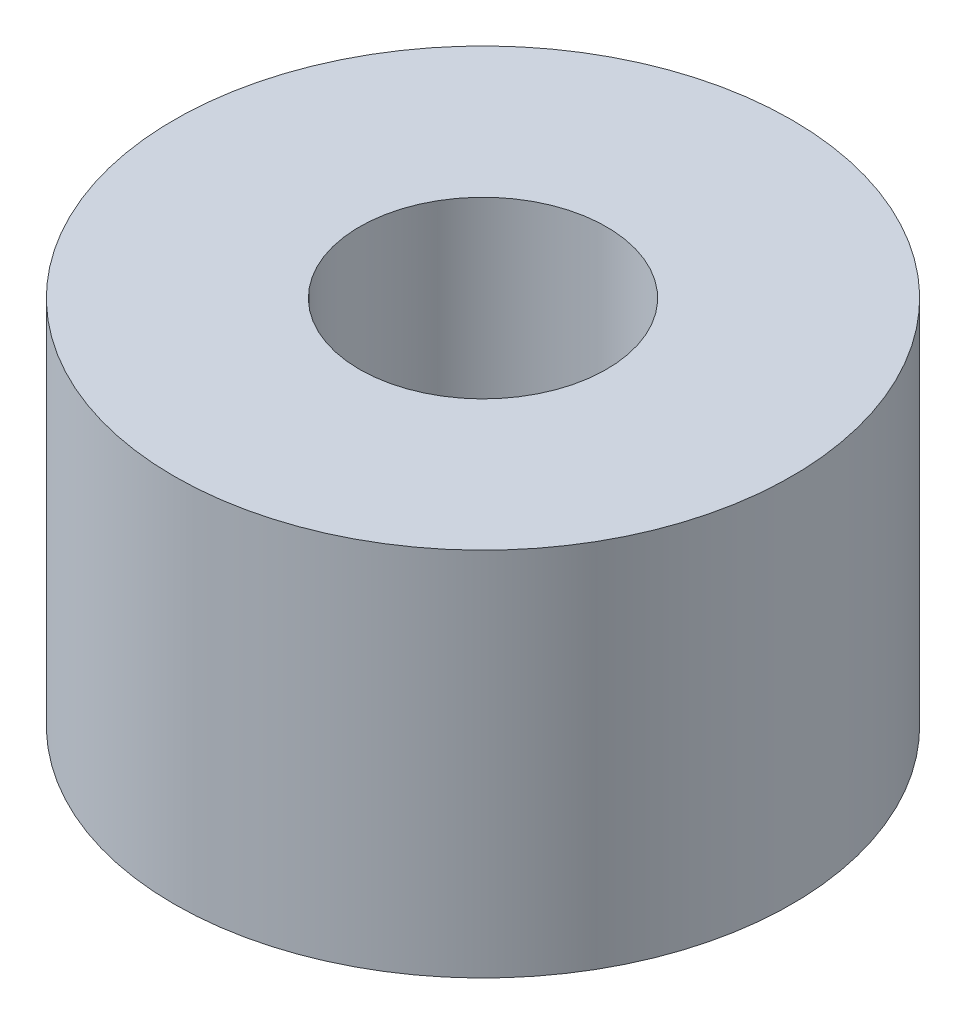
ISO-10303-21;
HEADER;
FILE_DESCRIPTION(('STEP AP214'),'2;1');
FILE_NAME('part.step','',(''),(''),'','','');
FILE_SCHEMA(('AUTOMOTIVE_DESIGN { 1 0 10303 214 1 1 1 1 }'));
ENDSEC;
DATA;
#1=APPLICATION_CONTEXT('core data for automotive mechanical design processes');
#2=APPLICATION_PROTOCOL_DEFINITION('international standard','automotive_design',2000,#1);
#3=PRODUCT_CONTEXT('',#1,'mechanical');
#4=PRODUCT('Part','Part','',(#3));
#5=PRODUCT_RELATED_PRODUCT_CATEGORY('part','',(#4));
#6=PRODUCT_DEFINITION_FORMATION('','',#4);
#7=PRODUCT_DEFINITION_CONTEXT('part definition',#1,'design');
#8=PRODUCT_DEFINITION('design','',#6,#7);
#9=PRODUCT_DEFINITION_SHAPE('','',#8);
#10=(LENGTH_UNIT() NAMED_UNIT(*) SI_UNIT(.MILLI.,.METRE.));
#11=(NAMED_UNIT(*) PLANE_ANGLE_UNIT() SI_UNIT($,.RADIAN.));
#12=(NAMED_UNIT(*) SI_UNIT($,.STERADIAN.) SOLID_ANGLE_UNIT());
#13=UNCERTAINTY_MEASURE_WITH_UNIT(LENGTH_MEASURE(1.E-05),#10,'distance_accuracy_value','');
#14=(GEOMETRIC_REPRESENTATION_CONTEXT(3) GLOBAL_UNCERTAINTY_ASSIGNED_CONTEXT((#13)) GLOBAL_UNIT_ASSIGNED_CONTEXT((#10,
#11,#12)) REPRESENTATION_CONTEXT('',''));
#15=CARTESIAN_POINT('',(0.,0.,0.));
#16=DIRECTION('',(0.,0.,1.));
#17=DIRECTION('',(1.,0.,0.));
#18=AXIS2_PLACEMENT_3D('',#15,#16,#17);
#19=CARTESIAN_POINT('',(0.,6.,0.));
#20=DIRECTION('',(0.,1.,0.));
#21=DIRECTION('',(0.,0.,1.));
#22=AXIS2_PLACEMENT_3D('',#19,#20,#21);
#23=PLANE('',#22);
#24=CARTESIAN_POINT('',(0.,6.,0.));
#25=DIRECTION('',(0.,1.,0.));
#26=DIRECTION('',(0.,0.,1.));
#27=AXIS2_PLACEMENT_3D('',#24,#25,#26);
#28=CIRCLE('',#27,5.);
#29=CARTESIAN_POINT('',(0.,6.,5.));
#30=VERTEX_POINT('',#29);
#31=EDGE_CURVE('E10',#30,#30,#28,.T.);
#32=ORIENTED_EDGE('',*,*,#31,.T.);
#33=EDGE_LOOP('',(#32));
#34=FACE_BOUND('',#33,.T.);
#35=CARTESIAN_POINT('',(0.,6.,0.));
#36=DIRECTION('',(0.,1.,0.));
#37=DIRECTION('',(0.,0.,1.));
#38=AXIS2_PLACEMENT_3D('',#35,#36,#37);
#39=CIRCLE('',#38,2.);
#40=CARTESIAN_POINT('',(0.,6.,2.));
#41=VERTEX_POINT('',#40);
#42=EDGE_CURVE('E42',#41,#41,#39,.T.);
#43=ORIENTED_EDGE('',*,*,#42,.F.);
#44=EDGE_LOOP('',(#43));
#45=FACE_BOUND('',#44,.T.);
#46=ADVANCED_FACE('F31',(#34,#45),#23,.T.);
#47=CARTESIAN_POINT('',(0.,0.,0.));
#48=DIRECTION('',(0.,1.,0.));
#49=DIRECTION('',(0.,0.,1.));
#50=AXIS2_PLACEMENT_3D('',#47,#48,#49);
#51=PLANE('',#50);
#52=CARTESIAN_POINT('',(0.,0.,0.));
#53=DIRECTION('',(0.,1.,0.));
#54=DIRECTION('',(0.,0.,1.));
#55=AXIS2_PLACEMENT_3D('',#52,#53,#54);
#56=CIRCLE('',#55,5.);
#57=CARTESIAN_POINT('',(0.,0.,5.));
#58=VERTEX_POINT('',#57);
#59=EDGE_CURVE('E35',#58,#58,#56,.T.);
#60=ORIENTED_EDGE('',*,*,#59,.F.);
#61=EDGE_LOOP('',(#60));
#62=FACE_BOUND('',#61,.T.);
#63=CARTESIAN_POINT('',(0.,0.,0.));
#64=DIRECTION('',(0.,1.,0.));
#65=DIRECTION('',(0.,0.,1.));
#66=AXIS2_PLACEMENT_3D('',#63,#64,#65);
#67=CIRCLE('',#66,2.);
#68=CARTESIAN_POINT('',(0.,0.,2.));
#69=VERTEX_POINT('',#68);
#70=EDGE_CURVE('E44',#69,#69,#67,.T.);
#71=ORIENTED_EDGE('',*,*,#70,.T.);
#72=EDGE_LOOP('',(#71));
#73=FACE_BOUND('',#72,.T.);
#74=ADVANCED_FACE('F54',(#62,#73),#51,.F.);
#75=CARTESIAN_POINT('',(0.,6.,0.));
#76=DIRECTION('',(0.,-1.,0.));
#77=DIRECTION('',(0.,0.,-1.));
#78=AXIS2_PLACEMENT_3D('',#75,#76,#77);
#79=CYLINDRICAL_SURFACE('',#78,5.);
#80=ORIENTED_EDGE('',*,*,#31,.F.);
#81=EDGE_LOOP('',(#80));
#82=FACE_BOUND('',#81,.T.);
#83=ORIENTED_EDGE('',*,*,#59,.T.);
#84=EDGE_LOOP('',(#83));
#85=FACE_BOUND('',#84,.T.);
#86=ADVANCED_FACE('F33',(#82,#85),#79,.T.);
#87=CARTESIAN_POINT('',(0.,6.,0.));
#88=DIRECTION('',(0.,-1.,0.));
#89=DIRECTION('',(0.,0.,-1.));
#90=AXIS2_PLACEMENT_3D('',#87,#88,#89);
#91=CYLINDRICAL_SURFACE('',#90,2.);
#92=ORIENTED_EDGE('',*,*,#42,.T.);
#93=EDGE_LOOP('',(#92));
#94=FACE_BOUND('',#93,.T.);
#95=ORIENTED_EDGE('',*,*,#70,.F.);
#96=EDGE_LOOP('',(#95));
#97=FACE_BOUND('',#96,.T.);
#98=ADVANCED_FACE('F50',(#94,#97),#91,.F.);
#99=CLOSED_SHELL('',(#46,#74,#86,#98));
#100=MANIFOLD_SOLID_BREP('B2',#99);
#101=ADVANCED_BREP_SHAPE_REPRESENTATION('',(#18,#100),#14);
#102=SHAPE_DEFINITION_REPRESENTATION(#9,#101);
ENDSEC;
END-ISO-10303-21;
